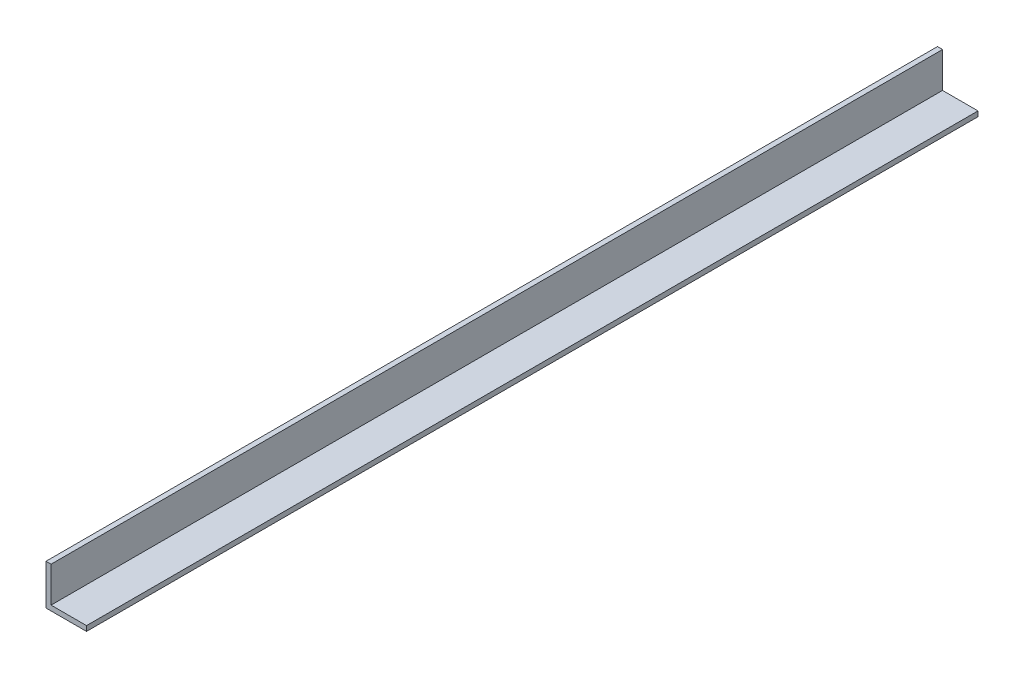
ISO-10303-21;
HEADER;
FILE_DESCRIPTION(('STEP AP214'),'2;1');
FILE_NAME('part.step','',(''),(''),'','','');
FILE_SCHEMA(('AUTOMOTIVE_DESIGN { 1 0 10303 214 1 1 1 1 }'));
ENDSEC;
DATA;
#1=APPLICATION_CONTEXT('core data for automotive mechanical design processes');
#2=APPLICATION_PROTOCOL_DEFINITION('international standard','automotive_design',2000,#1);
#3=PRODUCT_CONTEXT('',#1,'mechanical');
#4=PRODUCT('Part','Part','',(#3));
#5=PRODUCT_RELATED_PRODUCT_CATEGORY('part','',(#4));
#6=PRODUCT_DEFINITION_FORMATION('','',#4);
#7=PRODUCT_DEFINITION_CONTEXT('part definition',#1,'design');
#8=PRODUCT_DEFINITION('design','',#6,#7);
#9=PRODUCT_DEFINITION_SHAPE('','',#8);
#10=(LENGTH_UNIT() NAMED_UNIT(*) SI_UNIT(.MILLI.,.METRE.));
#11=(NAMED_UNIT(*) PLANE_ANGLE_UNIT() SI_UNIT($,.RADIAN.));
#12=(NAMED_UNIT(*) SI_UNIT($,.STERADIAN.) SOLID_ANGLE_UNIT());
#13=UNCERTAINTY_MEASURE_WITH_UNIT(LENGTH_MEASURE(1.E-05),#10,'distance_accuracy_value','');
#14=(GEOMETRIC_REPRESENTATION_CONTEXT(3) GLOBAL_UNCERTAINTY_ASSIGNED_CONTEXT((#13)) GLOBAL_UNIT_ASSIGNED_CONTEXT((#10,
#11,#12)) REPRESENTATION_CONTEXT('',''));
#15=CARTESIAN_POINT('',(0.,0.,0.));
#16=DIRECTION('',(0.,0.,1.));
#17=DIRECTION('',(1.,0.,0.));
#18=AXIS2_PLACEMENT_3D('',#15,#16,#17);
#19=CARTESIAN_POINT('',(3.175,25.4,279.4));
#20=DIRECTION('',(0.,-1.,0.));
#21=DIRECTION('',(0.,0.,-1.));
#22=AXIS2_PLACEMENT_3D('',#19,#20,#21);
#23=PLANE('',#22);
#24=DIRECTION('',(-1.,0.,0.));
#25=VECTOR('',#24,1.);
#26=CARTESIAN_POINT('',(3.175,25.4,-279.4));
#27=LINE('',#26,#25);
#28=CARTESIAN_POINT('',(3.175,25.4,-279.4));
#29=VERTEX_POINT('',#28);
#30=CARTESIAN_POINT('',(0.,25.4,-279.4));
#31=VERTEX_POINT('',#30);
#32=EDGE_CURVE('E127',#29,#31,#27,.T.);
#33=ORIENTED_EDGE('',*,*,#32,.T.);
#34=DIRECTION('',(0.,0.,-1.));
#35=VECTOR('',#34,1.);
#36=CARTESIAN_POINT('',(0.,25.4,279.4));
#37=LINE('',#36,#35);
#38=CARTESIAN_POINT('',(0.,25.4,279.4));
#39=VERTEX_POINT('',#38);
#40=EDGE_CURVE('E11',#39,#31,#37,.T.);
#41=ORIENTED_EDGE('',*,*,#40,.F.);
#42=DIRECTION('',(-1.,0.,0.));
#43=VECTOR('',#42,1.);
#44=CARTESIAN_POINT('',(3.175,25.4,279.4));
#45=LINE('',#44,#43);
#46=CARTESIAN_POINT('',(3.175,25.4,279.4));
#47=VERTEX_POINT('',#46);
#48=EDGE_CURVE('E137',#47,#39,#45,.T.);
#49=ORIENTED_EDGE('',*,*,#48,.F.);
#50=DIRECTION('',(0.,0.,-1.));
#51=VECTOR('',#50,1.);
#52=CARTESIAN_POINT('',(3.175,25.4,279.4));
#53=LINE('',#52,#51);
#54=EDGE_CURVE('E123',#47,#29,#53,.T.);
#55=ORIENTED_EDGE('',*,*,#54,.T.);
#56=EDGE_LOOP('',(#33,#41,#49,#55));
#57=FACE_BOUND('',#56,.T.);
#58=ADVANCED_FACE('F43',(#57),#23,.F.);
#59=CARTESIAN_POINT('',(0.,25.4,279.4));
#60=DIRECTION('',(1.,0.,0.));
#61=DIRECTION('',(0.,0.,-1.));
#62=AXIS2_PLACEMENT_3D('',#59,#60,#61);
#63=PLANE('',#62);
#64=DIRECTION('',(0.,-1.,0.));
#65=VECTOR('',#64,1.);
#66=CARTESIAN_POINT('',(0.,25.4,-279.4));
#67=LINE('',#66,#65);
#68=CARTESIAN_POINT('',(0.,0.,-279.4));
#69=VERTEX_POINT('',#68);
#70=EDGE_CURVE('E130',#31,#69,#67,.T.);
#71=ORIENTED_EDGE('',*,*,#70,.T.);
#72=DIRECTION('',(0.,0.,-1.));
#73=VECTOR('',#72,1.);
#74=CARTESIAN_POINT('',(0.,0.,279.4));
#75=LINE('',#74,#73);
#76=CARTESIAN_POINT('',(0.,0.,279.4));
#77=VERTEX_POINT('',#76);
#78=EDGE_CURVE('E51',#77,#69,#75,.T.);
#79=ORIENTED_EDGE('',*,*,#78,.F.);
#80=DIRECTION('',(0.,-1.,0.));
#81=VECTOR('',#80,1.);
#82=CARTESIAN_POINT('',(0.,25.4,279.4));
#83=LINE('',#82,#81);
#84=EDGE_CURVE('E96',#39,#77,#83,.T.);
#85=ORIENTED_EDGE('',*,*,#84,.F.);
#86=ORIENTED_EDGE('',*,*,#40,.T.);
#87=EDGE_LOOP('',(#71,#79,#85,#86));
#88=FACE_BOUND('',#87,.T.);
#89=ADVANCED_FACE('F161',(#88),#63,.F.);
#90=CARTESIAN_POINT('',(0.,0.,279.4));
#91=DIRECTION('',(0.,1.,0.));
#92=DIRECTION('',(0.,0.,1.));
#93=AXIS2_PLACEMENT_3D('',#90,#91,#92);
#94=PLANE('',#93);
#95=DIRECTION('',(1.,0.,0.));
#96=VECTOR('',#95,1.);
#97=CARTESIAN_POINT('',(0.,0.,-279.4));
#98=LINE('',#97,#96);
#99=CARTESIAN_POINT('',(25.4,0.,-279.4));
#100=VERTEX_POINT('',#99);
#101=EDGE_CURVE('E132',#69,#100,#98,.T.);
#102=ORIENTED_EDGE('',*,*,#101,.T.);
#103=DIRECTION('',(0.,0.,-1.));
#104=VECTOR('',#103,1.);
#105=CARTESIAN_POINT('',(25.4,0.,279.4));
#106=LINE('',#105,#104);
#107=CARTESIAN_POINT('',(25.4,0.,279.4));
#108=VERTEX_POINT('',#107);
#109=EDGE_CURVE('E118',#108,#100,#106,.T.);
#110=ORIENTED_EDGE('',*,*,#109,.F.);
#111=DIRECTION('',(1.,0.,0.));
#112=VECTOR('',#111,1.);
#113=CARTESIAN_POINT('',(0.,0.,279.4));
#114=LINE('',#113,#112);
#115=EDGE_CURVE('E109',#77,#108,#114,.T.);
#116=ORIENTED_EDGE('',*,*,#115,.F.);
#117=ORIENTED_EDGE('',*,*,#78,.T.);
#118=EDGE_LOOP('',(#102,#110,#116,#117));
#119=FACE_BOUND('',#118,.T.);
#120=ADVANCED_FACE('F143',(#119),#94,.F.);
#121=CARTESIAN_POINT('',(25.4,0.,279.4));
#122=DIRECTION('',(-1.,0.,0.));
#123=DIRECTION('',(0.,0.,1.));
#124=AXIS2_PLACEMENT_3D('',#121,#122,#123);
#125=PLANE('',#124);
#126=DIRECTION('',(0.,1.,0.));
#127=VECTOR('',#126,1.);
#128=CARTESIAN_POINT('',(25.4,0.,-279.4));
#129=LINE('',#128,#127);
#130=CARTESIAN_POINT('',(25.4,3.175,-279.4));
#131=VERTEX_POINT('',#130);
#132=EDGE_CURVE('E117',#100,#131,#129,.T.);
#133=ORIENTED_EDGE('',*,*,#132,.T.);
#134=DIRECTION('',(0.,0.,-1.));
#135=VECTOR('',#134,1.);
#136=CARTESIAN_POINT('',(25.4,3.175,279.4));
#137=LINE('',#136,#135);
#138=CARTESIAN_POINT('',(25.4,3.175,279.4));
#139=VERTEX_POINT('',#138);
#140=EDGE_CURVE('E114',#139,#131,#137,.T.);
#141=ORIENTED_EDGE('',*,*,#140,.F.);
#142=DIRECTION('',(0.,1.,0.));
#143=VECTOR('',#142,1.);
#144=CARTESIAN_POINT('',(25.4,0.,279.4));
#145=LINE('',#144,#143);
#146=EDGE_CURVE('E103',#108,#139,#145,.T.);
#147=ORIENTED_EDGE('',*,*,#146,.F.);
#148=ORIENTED_EDGE('',*,*,#109,.T.);
#149=EDGE_LOOP('',(#133,#141,#147,#148));
#150=FACE_BOUND('',#149,.T.);
#151=ADVANCED_FACE('F115',(#150),#125,.F.);
#152=CARTESIAN_POINT('',(25.4,3.175,279.4));
#153=DIRECTION('',(0.,-1.,0.));
#154=DIRECTION('',(1.,0.,0.));
#155=AXIS2_PLACEMENT_3D('',#152,#153,#154);
#156=PLANE('',#155);
#157=DIRECTION('',(-1.,0.,0.));
#158=VECTOR('',#157,1.);
#159=CARTESIAN_POINT('',(25.4,3.175,-279.4));
#160=LINE('',#159,#158);
#161=CARTESIAN_POINT('',(3.175,3.175,-279.4));
#162=VERTEX_POINT('',#161);
#163=EDGE_CURVE('E82',#131,#162,#160,.T.);
#164=ORIENTED_EDGE('',*,*,#163,.T.);
#165=DIRECTION('',(0.,0.,-1.));
#166=VECTOR('',#165,1.);
#167=CARTESIAN_POINT('',(3.175,3.175,279.4));
#168=LINE('',#167,#166);
#169=CARTESIAN_POINT('',(3.175,3.175,279.4));
#170=VERTEX_POINT('',#169);
#171=EDGE_CURVE('E119',#170,#162,#168,.T.);
#172=ORIENTED_EDGE('',*,*,#171,.F.);
#173=DIRECTION('',(-1.,0.,0.));
#174=VECTOR('',#173,1.);
#175=CARTESIAN_POINT('',(25.4,3.175,279.4));
#176=LINE('',#175,#174);
#177=EDGE_CURVE('E107',#139,#170,#176,.T.);
#178=ORIENTED_EDGE('',*,*,#177,.F.);
#179=ORIENTED_EDGE('',*,*,#140,.T.);
#180=EDGE_LOOP('',(#164,#172,#178,#179));
#181=FACE_BOUND('',#180,.T.);
#182=ADVANCED_FACE('F121',(#181),#156,.F.);
#183=CARTESIAN_POINT('',(3.175,3.175,279.4));
#184=DIRECTION('',(-1.,0.,0.));
#185=DIRECTION('',(0.,0.,1.));
#186=AXIS2_PLACEMENT_3D('',#183,#184,#185);
#187=PLANE('',#186);
#188=DIRECTION('',(0.,1.,0.));
#189=VECTOR('',#188,1.);
#190=CARTESIAN_POINT('',(3.175,3.175,-279.4));
#191=LINE('',#190,#189);
#192=EDGE_CURVE('E88',#162,#29,#191,.T.);
#193=ORIENTED_EDGE('',*,*,#192,.T.);
#194=ORIENTED_EDGE('',*,*,#54,.F.);
#195=DIRECTION('',(0.,1.,0.));
#196=VECTOR('',#195,1.);
#197=CARTESIAN_POINT('',(3.175,3.175,279.4));
#198=LINE('',#197,#196);
#199=EDGE_CURVE('E59',#170,#47,#198,.T.);
#200=ORIENTED_EDGE('',*,*,#199,.F.);
#201=ORIENTED_EDGE('',*,*,#171,.T.);
#202=EDGE_LOOP('',(#193,#194,#200,#201));
#203=FACE_BOUND('',#202,.T.);
#204=ADVANCED_FACE('F150',(#203),#187,.F.);
#205=CARTESIAN_POINT('',(0.,0.,279.4));
#206=DIRECTION('',(0.,0.,1.));
#207=DIRECTION('',(1.,0.,0.));
#208=AXIS2_PLACEMENT_3D('',#205,#206,#207);
#209=PLANE('',#208);
#210=ORIENTED_EDGE('',*,*,#48,.T.);
#211=ORIENTED_EDGE('',*,*,#84,.T.);
#212=ORIENTED_EDGE('',*,*,#115,.T.);
#213=ORIENTED_EDGE('',*,*,#146,.T.);
#214=ORIENTED_EDGE('',*,*,#177,.T.);
#215=ORIENTED_EDGE('',*,*,#199,.T.);
#216=EDGE_LOOP('',(#210,#211,#212,#213,#214,#215));
#217=FACE_BOUND('',#216,.T.);
#218=ADVANCED_FACE('F105',(#217),#209,.T.);
#219=CARTESIAN_POINT('',(0.,0.,-279.4));
#220=DIRECTION('',(0.,0.,1.));
#221=DIRECTION('',(1.,0.,0.));
#222=AXIS2_PLACEMENT_3D('',#219,#220,#221);
#223=PLANE('',#222);
#224=ORIENTED_EDGE('',*,*,#32,.F.);
#225=ORIENTED_EDGE('',*,*,#192,.F.);
#226=ORIENTED_EDGE('',*,*,#163,.F.);
#227=ORIENTED_EDGE('',*,*,#132,.F.);
#228=ORIENTED_EDGE('',*,*,#101,.F.);
#229=ORIENTED_EDGE('',*,*,#70,.F.);
#230=EDGE_LOOP('',(#224,#225,#226,#227,#228,#229));
#231=FACE_BOUND('',#230,.T.);
#232=ADVANCED_FACE('F146',(#231),#223,.F.);
#233=CLOSED_SHELL('',(#58,#89,#120,#151,#182,#204,#218,#232));
#234=MANIFOLD_SOLID_BREP('B2',#233);
#235=ADVANCED_BREP_SHAPE_REPRESENTATION('',(#18,#234),#14);
#236=SHAPE_DEFINITION_REPRESENTATION(#9,#235);
ENDSEC;
END-ISO-10303-21;
